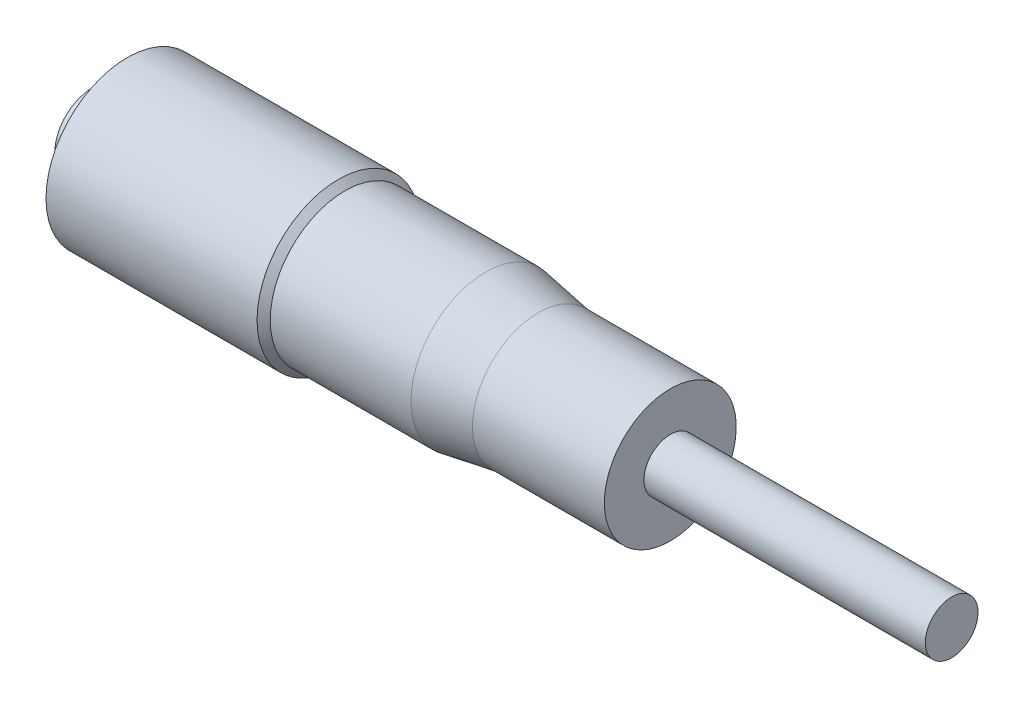
ISO-10303-21;
HEADER;
FILE_DESCRIPTION(('STEP AP214'),'2;1');
FILE_NAME('part.step','',(''),(''),'','','');
FILE_SCHEMA(('AUTOMOTIVE_DESIGN { 1 0 10303 214 1 1 1 1 }'));
ENDSEC;
DATA;
#1=APPLICATION_CONTEXT('core data for automotive mechanical design processes');
#2=APPLICATION_PROTOCOL_DEFINITION('international standard','automotive_design',2000,#1);
#3=PRODUCT_CONTEXT('',#1,'mechanical');
#4=PRODUCT('Part','Part','',(#3));
#5=PRODUCT_RELATED_PRODUCT_CATEGORY('part','',(#4));
#6=PRODUCT_DEFINITION_FORMATION('','',#4);
#7=PRODUCT_DEFINITION_CONTEXT('part definition',#1,'design');
#8=PRODUCT_DEFINITION('design','',#6,#7);
#9=PRODUCT_DEFINITION_SHAPE('','',#8);
#10=(LENGTH_UNIT() NAMED_UNIT(*) SI_UNIT(.MILLI.,.METRE.));
#11=(NAMED_UNIT(*) PLANE_ANGLE_UNIT() SI_UNIT($,.RADIAN.));
#12=(NAMED_UNIT(*) SI_UNIT($,.STERADIAN.) SOLID_ANGLE_UNIT());
#13=UNCERTAINTY_MEASURE_WITH_UNIT(LENGTH_MEASURE(1.E-05),#10,'distance_accuracy_value','');
#14=(GEOMETRIC_REPRESENTATION_CONTEXT(3) GLOBAL_UNCERTAINTY_ASSIGNED_CONTEXT((#13)) GLOBAL_UNIT_ASSIGNED_CONTEXT((#10,
#11,#12)) REPRESENTATION_CONTEXT('',''));
#15=CARTESIAN_POINT('',(0.,0.,0.));
#16=DIRECTION('',(0.,0.,1.));
#17=DIRECTION('',(1.,0.,0.));
#18=AXIS2_PLACEMENT_3D('',#15,#16,#17);
#19=CARTESIAN_POINT('',(-39.8437499999999,0.,0.));
#20=DIRECTION('',(-1.,0.,0.));
#21=DIRECTION('',(0.,1.,0.));
#22=AXIS2_PLACEMENT_3D('',#19,#20,#21);
#23=SPHERICAL_SURFACE('',#22,9.53125000000007);
#24=CARTESIAN_POINT('',(-48.375,0.,0.));
#25=DIRECTION('',(-1.,0.,0.));
#26=DIRECTION('',(0.,0.,1.));
#27=AXIS2_PLACEMENT_3D('',#24,#25,#26);
#28=CIRCLE('',#27,4.25000000000001);
#29=CARTESIAN_POINT('',(-48.375,0.,4.25000000000001));
#30=VERTEX_POINT('',#29);
#31=EDGE_CURVE('E68',#30,#30,#28,.T.);
#32=ORIENTED_EDGE('',*,*,#31,.T.);
#33=EDGE_LOOP('',(#32));
#34=FACE_BOUND('',#33,.T.);
#35=ADVANCED_FACE('F34',(#34),#23,.T.);
#36=CARTESIAN_POINT('',(49.375,0.,0.));
#37=DIRECTION('',(-1.,0.,0.));
#38=DIRECTION('',(0.,0.,1.));
#39=AXIS2_PLACEMENT_3D('',#36,#37,#38);
#40=PLANE('',#39);
#41=CARTESIAN_POINT('',(49.375,0.,0.));
#42=DIRECTION('',(-1.,0.,0.));
#43=DIRECTION('',(0.,0.,1.));
#44=AXIS2_PLACEMENT_3D('',#41,#42,#43);
#45=CIRCLE('',#44,3.);
#46=CARTESIAN_POINT('',(49.375,0.,3.));
#47=VERTEX_POINT('',#46);
#48=EDGE_CURVE('E10',#47,#47,#45,.T.);
#49=ORIENTED_EDGE('',*,*,#48,.F.);
#50=EDGE_LOOP('',(#49));
#51=FACE_BOUND('',#50,.T.);
#52=ADVANCED_FACE('F122',(#51),#40,.F.);
#53=CARTESIAN_POINT('',(0.,0.,0.));
#54=DIRECTION('',(-1.,0.,0.));
#55=DIRECTION('',(0.,0.,1.));
#56=AXIS2_PLACEMENT_3D('',#53,#54,#55);
#57=CYLINDRICAL_SURFACE('',#56,3.);
#58=CARTESIAN_POINT('',(17.375,0.,0.));
#59=DIRECTION('',(-1.,0.,0.));
#60=DIRECTION('',(0.,0.,1.));
#61=AXIS2_PLACEMENT_3D('',#58,#59,#60);
#62=CIRCLE('',#61,3.);
#63=CARTESIAN_POINT('',(17.375,0.,3.));
#64=VERTEX_POINT('',#63);
#65=EDGE_CURVE('E40',#64,#64,#62,.T.);
#66=ORIENTED_EDGE('',*,*,#65,.F.);
#67=EDGE_LOOP('',(#66));
#68=FACE_BOUND('',#67,.T.);
#69=ORIENTED_EDGE('',*,*,#48,.T.);
#70=EDGE_LOOP('',(#69));
#71=FACE_BOUND('',#70,.T.);
#72=ADVANCED_FACE('F117',(#68,#71),#57,.T.);
#73=CARTESIAN_POINT('',(17.375,3.,0.));
#74=DIRECTION('',(-1.,0.,0.));
#75=DIRECTION('',(0.,0.,1.));
#76=AXIS2_PLACEMENT_3D('',#73,#74,#75);
#77=PLANE('',#76);
#78=CARTESIAN_POINT('',(17.375,0.,0.));
#79=DIRECTION('',(-1.,0.,0.));
#80=DIRECTION('',(0.,0.,1.));
#81=AXIS2_PLACEMENT_3D('',#78,#79,#80);
#82=CIRCLE('',#81,7.50000000000001);
#83=CARTESIAN_POINT('',(17.375,0.,7.50000000000001));
#84=VERTEX_POINT('',#83);
#85=EDGE_CURVE('E44',#84,#84,#82,.T.);
#86=ORIENTED_EDGE('',*,*,#85,.F.);
#87=EDGE_LOOP('',(#86));
#88=FACE_BOUND('',#87,.T.);
#89=ORIENTED_EDGE('',*,*,#65,.T.);
#90=EDGE_LOOP('',(#89));
#91=FACE_BOUND('',#90,.T.);
#92=ADVANCED_FACE('F112',(#88,#91),#77,.F.);
#93=CARTESIAN_POINT('',(0.,0.,0.));
#94=DIRECTION('',(-1.,0.,0.));
#95=DIRECTION('',(0.,0.,1.));
#96=AXIS2_PLACEMENT_3D('',#93,#94,#95);
#97=CYLINDRICAL_SURFACE('',#96,7.50000000000001);
#98=CARTESIAN_POINT('',(2.375,0.,0.));
#99=DIRECTION('',(-1.,0.,0.));
#100=DIRECTION('',(0.,0.,1.));
#101=AXIS2_PLACEMENT_3D('',#98,#99,#100);
#102=CIRCLE('',#101,7.50000000000001);
#103=CARTESIAN_POINT('',(2.375,0.,7.50000000000001));
#104=VERTEX_POINT('',#103);
#105=EDGE_CURVE('E48',#104,#104,#102,.T.);
#106=ORIENTED_EDGE('',*,*,#105,.F.);
#107=EDGE_LOOP('',(#106));
#108=FACE_BOUND('',#107,.T.);
#109=ORIENTED_EDGE('',*,*,#85,.T.);
#110=EDGE_LOOP('',(#109));
#111=FACE_BOUND('',#110,.T.);
#112=ADVANCED_FACE('F106',(#108,#111),#97,.T.);
#113=CARTESIAN_POINT('',(2.375,0.,0.));
#114=DIRECTION('',(-1.,0.,0.));
#115=DIRECTION('',(0.,0.,1.));
#116=AXIS2_PLACEMENT_3D('',#113,#114,#115);
#117=CONICAL_SURFACE('',#116,7.50000000000001,0.165148677414626);
#118=CARTESIAN_POINT('',(-3.625,0.,0.));
#119=DIRECTION('',(-1.,0.,0.));
#120=DIRECTION('',(0.,0.,1.));
#121=AXIS2_PLACEMENT_3D('',#118,#119,#120);
#122=CIRCLE('',#121,8.5);
#123=CARTESIAN_POINT('',(-3.625,0.,8.5));
#124=VERTEX_POINT('',#123);
#125=EDGE_CURVE('E53',#124,#124,#122,.T.);
#126=ORIENTED_EDGE('',*,*,#125,.F.);
#127=EDGE_LOOP('',(#126));
#128=FACE_BOUND('',#127,.T.);
#129=ORIENTED_EDGE('',*,*,#105,.T.);
#130=EDGE_LOOP('',(#129));
#131=FACE_BOUND('',#130,.T.);
#132=ADVANCED_FACE('F100',(#128,#131),#117,.T.);
#133=CARTESIAN_POINT('',(0.,0.,0.));
#134=DIRECTION('',(-1.,0.,0.));
#135=DIRECTION('',(0.,0.,1.));
#136=AXIS2_PLACEMENT_3D('',#133,#134,#135);
#137=CYLINDRICAL_SURFACE('',#136,8.5);
#138=CARTESIAN_POINT('',(-19.625,0.,0.));
#139=DIRECTION('',(-1.,0.,0.));
#140=DIRECTION('',(0.,0.,1.));
#141=AXIS2_PLACEMENT_3D('',#138,#139,#140);
#142=CIRCLE('',#141,8.50000000000001);
#143=CARTESIAN_POINT('',(-19.625,0.,8.50000000000001));
#144=VERTEX_POINT('',#143);
#145=EDGE_CURVE('E56',#144,#144,#142,.T.);
#146=ORIENTED_EDGE('',*,*,#145,.F.);
#147=EDGE_LOOP('',(#146));
#148=FACE_BOUND('',#147,.T.);
#149=ORIENTED_EDGE('',*,*,#125,.T.);
#150=EDGE_LOOP('',(#149));
#151=FACE_BOUND('',#150,.T.);
#152=ADVANCED_FACE('F94',(#148,#151),#137,.T.);
#153=CARTESIAN_POINT('',(-19.625,0.,0.));
#154=DIRECTION('',(-1.,0.,0.));
#155=DIRECTION('',(0.,0.,1.));
#156=AXIS2_PLACEMENT_3D('',#153,#154,#155);
#157=CONICAL_SURFACE('',#156,8.50000000000001,0.785398163397451);
#158=CARTESIAN_POINT('',(-20.375,0.,0.));
#159=DIRECTION('',(-1.,0.,0.));
#160=DIRECTION('',(0.,0.,1.));
#161=AXIS2_PLACEMENT_3D('',#158,#159,#160);
#162=CIRCLE('',#161,9.25);
#163=CARTESIAN_POINT('',(-20.375,0.,9.25));
#164=VERTEX_POINT('',#163);
#165=EDGE_CURVE('E59',#164,#164,#162,.T.);
#166=ORIENTED_EDGE('',*,*,#165,.F.);
#167=EDGE_LOOP('',(#166));
#168=FACE_BOUND('',#167,.T.);
#169=ORIENTED_EDGE('',*,*,#145,.T.);
#170=EDGE_LOOP('',(#169));
#171=FACE_BOUND('',#170,.T.);
#172=ADVANCED_FACE('F88',(#168,#171),#157,.T.);
#173=CARTESIAN_POINT('',(0.,0.,0.));
#174=DIRECTION('',(-1.,0.,0.));
#175=DIRECTION('',(0.,0.,1.));
#176=AXIS2_PLACEMENT_3D('',#173,#174,#175);
#177=CYLINDRICAL_SURFACE('',#176,9.25);
#178=CARTESIAN_POINT('',(-44.375,0.,0.));
#179=DIRECTION('',(-1.,0.,0.));
#180=DIRECTION('',(0.,0.,1.));
#181=AXIS2_PLACEMENT_3D('',#178,#179,#180);
#182=CIRCLE('',#181,9.25);
#183=CARTESIAN_POINT('',(-44.375,0.,9.25));
#184=VERTEX_POINT('',#183);
#185=EDGE_CURVE('E62',#184,#184,#182,.T.);
#186=ORIENTED_EDGE('',*,*,#185,.F.);
#187=EDGE_LOOP('',(#186));
#188=FACE_BOUND('',#187,.T.);
#189=ORIENTED_EDGE('',*,*,#165,.T.);
#190=EDGE_LOOP('',(#189));
#191=FACE_BOUND('',#190,.T.);
#192=ADVANCED_FACE('F82',(#188,#191),#177,.T.);
#193=CARTESIAN_POINT('',(-44.375,0.,0.));
#194=DIRECTION('',(1.,0.,0.));
#195=DIRECTION('',(0.,0.,-1.));
#196=AXIS2_PLACEMENT_3D('',#193,#194,#195);
#197=CONICAL_SURFACE('',#196,9.25,1.27933953231703);
#198=CARTESIAN_POINT('',(-45.875,0.,0.));
#199=DIRECTION('',(-1.,0.,0.));
#200=DIRECTION('',(0.,0.,1.));
#201=AXIS2_PLACEMENT_3D('',#198,#199,#200);
#202=CIRCLE('',#201,4.25);
#203=CARTESIAN_POINT('',(-45.875,0.,4.25));
#204=VERTEX_POINT('',#203);
#205=EDGE_CURVE('E65',#204,#204,#202,.T.);
#206=ORIENTED_EDGE('',*,*,#205,.F.);
#207=EDGE_LOOP('',(#206));
#208=FACE_BOUND('',#207,.T.);
#209=ORIENTED_EDGE('',*,*,#185,.T.);
#210=EDGE_LOOP('',(#209));
#211=FACE_BOUND('',#210,.T.);
#212=ADVANCED_FACE('F76',(#208,#211),#197,.T.);
#213=CARTESIAN_POINT('',(0.,0.,0.));
#214=DIRECTION('',(-1.,0.,0.));
#215=DIRECTION('',(0.,0.,1.));
#216=AXIS2_PLACEMENT_3D('',#213,#214,#215);
#217=CYLINDRICAL_SURFACE('',#216,4.25);
#218=ORIENTED_EDGE('',*,*,#31,.F.);
#219=EDGE_LOOP('',(#218));
#220=FACE_BOUND('',#219,.T.);
#221=ORIENTED_EDGE('',*,*,#205,.T.);
#222=EDGE_LOOP('',(#221));
#223=FACE_BOUND('',#222,.T.);
#224=ADVANCED_FACE('F73',(#220,#223),#217,.T.);
#225=CLOSED_SHELL('',(#35,#52,#72,#92,#112,#132,#152,#172,#192,#212,#224));
#226=MANIFOLD_SOLID_BREP('B2',#225);
#227=ADVANCED_BREP_SHAPE_REPRESENTATION('',(#18,#226),#14);
#228=SHAPE_DEFINITION_REPRESENTATION(#9,#227);
ENDSEC;
END-ISO-10303-21;
